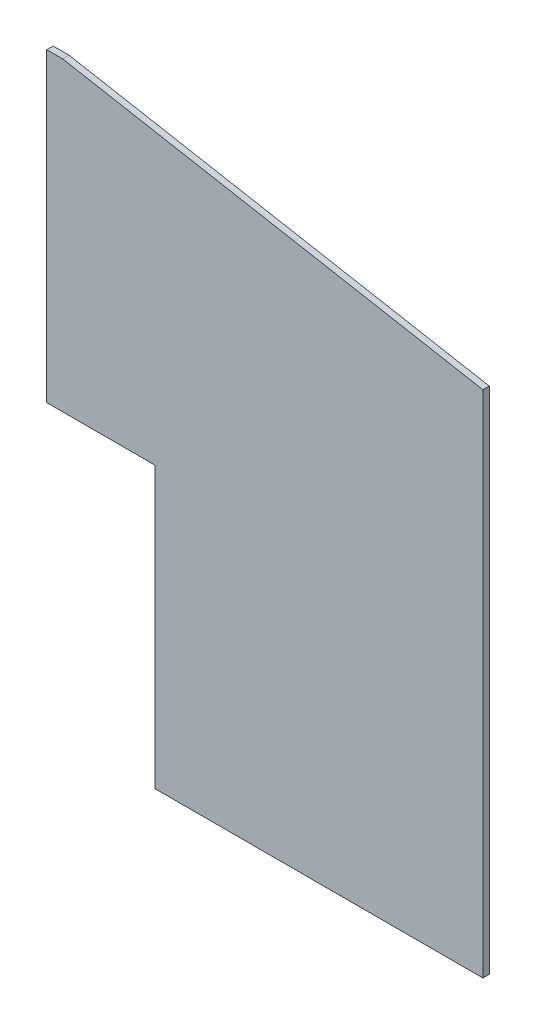
ISO-10303-21;
HEADER;
FILE_DESCRIPTION(('STEP AP214'),'2;1');
FILE_NAME('part.step','',(''),(''),'','','');
FILE_SCHEMA(('AUTOMOTIVE_DESIGN { 1 0 10303 214 1 1 1 1 }'));
ENDSEC;
DATA;
#1=APPLICATION_CONTEXT('core data for automotive mechanical design processes');
#2=APPLICATION_PROTOCOL_DEFINITION('international standard','automotive_design',2000,#1);
#3=PRODUCT_CONTEXT('',#1,'mechanical');
#4=PRODUCT('Part','Part','',(#3));
#5=PRODUCT_RELATED_PRODUCT_CATEGORY('part','',(#4));
#6=PRODUCT_DEFINITION_FORMATION('','',#4);
#7=PRODUCT_DEFINITION_CONTEXT('part definition',#1,'design');
#8=PRODUCT_DEFINITION('design','',#6,#7);
#9=PRODUCT_DEFINITION_SHAPE('','',#8);
#10=(LENGTH_UNIT() NAMED_UNIT(*) SI_UNIT(.MILLI.,.METRE.));
#11=(NAMED_UNIT(*) PLANE_ANGLE_UNIT() SI_UNIT($,.RADIAN.));
#12=(NAMED_UNIT(*) SI_UNIT($,.STERADIAN.) SOLID_ANGLE_UNIT());
#13=UNCERTAINTY_MEASURE_WITH_UNIT(LENGTH_MEASURE(1.E-05),#10,'distance_accuracy_value','');
#14=(GEOMETRIC_REPRESENTATION_CONTEXT(3) GLOBAL_UNCERTAINTY_ASSIGNED_CONTEXT((#13)) GLOBAL_UNIT_ASSIGNED_CONTEXT((#10,
#11,#12)) REPRESENTATION_CONTEXT('',''));
#15=CARTESIAN_POINT('',(0.,0.,0.));
#16=DIRECTION('',(0.,0.,1.));
#17=DIRECTION('',(1.,0.,0.));
#18=AXIS2_PLACEMENT_3D('',#15,#16,#17);
#19=CARTESIAN_POINT('',(2500.,-1.18616867488059E-13,-10.));
#20=DIRECTION('',(0.,-1.,0.));
#21=DIRECTION('',(1.,0.,0.));
#22=AXIS2_PLACEMENT_3D('',#19,#20,#21);
#23=PLANE('',#22);
#24=DIRECTION('',(0.,0.,1.));
#25=VECTOR('',#24,1.);
#26=CARTESIAN_POINT('',(1985.,0.,-10.));
#27=LINE('',#26,#25);
#28=CARTESIAN_POINT('',(1985.,0.,-10.));
#29=VERTEX_POINT('',#28);
#30=CARTESIAN_POINT('',(1985.,0.,0.));
#31=VERTEX_POINT('',#30);
#32=EDGE_CURVE('E61',#29,#31,#27,.T.);
#33=ORIENTED_EDGE('',*,*,#32,.F.);
#34=DIRECTION('',(1.,0.,0.));
#35=VECTOR('',#34,1.);
#36=CARTESIAN_POINT('',(2500.,-1.18616867488059E-13,-10.));
#37=LINE('',#36,#35);
#38=CARTESIAN_POINT('',(2500.,-1.18616867488059E-13,-10.));
#39=VERTEX_POINT('',#38);
#40=EDGE_CURVE('E140',#29,#39,#37,.T.);
#41=ORIENTED_EDGE('',*,*,#40,.T.);
#42=DIRECTION('',(0.,0.,1.));
#43=VECTOR('',#42,1.);
#44=CARTESIAN_POINT('',(2500.,-1.18616867488059E-13,-10.));
#45=LINE('',#44,#43);
#46=CARTESIAN_POINT('',(2500.,-1.18616867488059E-13,0.));
#47=VERTEX_POINT('',#46);
#48=EDGE_CURVE('E119',#39,#47,#45,.T.);
#49=ORIENTED_EDGE('',*,*,#48,.T.);
#50=DIRECTION('',(1.,0.,0.));
#51=VECTOR('',#50,1.);
#52=CARTESIAN_POINT('',(2500.,-1.18616867488059E-13,0.));
#53=LINE('',#52,#51);
#54=EDGE_CURVE('E129',#31,#47,#53,.T.);
#55=ORIENTED_EDGE('',*,*,#54,.F.);
#56=EDGE_LOOP('',(#33,#41,#49,#55));
#57=FACE_BOUND('',#56,.T.);
#58=ADVANCED_FACE('F40',(#57),#23,.T.);
#59=CARTESIAN_POINT('',(660.,920.,-10.));
#60=DIRECTION('',(0.,1.,0.));
#61=DIRECTION('',(-1.,0.,0.));
#62=AXIS2_PLACEMENT_3D('',#59,#60,#61);
#63=PLANE('',#62);
#64=DIRECTION('',(0.,0.,-1.));
#65=VECTOR('',#64,1.);
#66=CARTESIAN_POINT('',(1815.,920.,-10.));
#67=LINE('',#66,#65);
#68=CARTESIAN_POINT('',(1815.,920.,0.));
#69=VERTEX_POINT('',#68);
#70=CARTESIAN_POINT('',(1815.,920.,-10.));
#71=VERTEX_POINT('',#70);
#72=EDGE_CURVE('E96',#69,#71,#67,.T.);
#73=ORIENTED_EDGE('',*,*,#72,.F.);
#74=DIRECTION('',(-1.,0.,0.));
#75=VECTOR('',#74,1.);
#76=CARTESIAN_POINT('',(660.,920.,0.));
#77=LINE('',#76,#75);
#78=CARTESIAN_POINT('',(1840.,920.,0.));
#79=VERTEX_POINT('',#78);
#80=EDGE_CURVE('E138',#79,#69,#77,.T.);
#81=ORIENTED_EDGE('',*,*,#80,.F.);
#82=DIRECTION('',(0.,0.,1.));
#83=VECTOR('',#82,1.);
#84=CARTESIAN_POINT('',(1840.,920.,-10.));
#85=LINE('',#84,#83);
#86=CARTESIAN_POINT('',(1840.,920.,-10.));
#87=VERTEX_POINT('',#86);
#88=EDGE_CURVE('E118',#87,#79,#85,.T.);
#89=ORIENTED_EDGE('',*,*,#88,.F.);
#90=DIRECTION('',(-1.,0.,0.));
#91=VECTOR('',#90,1.);
#92=CARTESIAN_POINT('',(660.,920.,-10.));
#93=LINE('',#92,#91);
#94=EDGE_CURVE('E111',#87,#71,#93,.T.);
#95=ORIENTED_EDGE('',*,*,#94,.T.);
#96=EDGE_LOOP('',(#73,#81,#89,#95));
#97=FACE_BOUND('',#96,.T.);
#98=ADVANCED_FACE('F117',(#97),#63,.T.);
#99=CARTESIAN_POINT('',(1840.,920.,-10.));
#100=DIRECTION('',(0.178885438199983,0.983869910099907,0.));
#101=DIRECTION('',(-0.983869910099907,0.178885438199983,0.));
#102=AXIS2_PLACEMENT_3D('',#99,#100,#101);
#103=PLANE('',#102);
#104=DIRECTION('',(-0.983869910099908,0.178885438199983,0.));
#105=VECTOR('',#104,1.);
#106=CARTESIAN_POINT('',(1840.,920.,0.));
#107=LINE('',#106,#105);
#108=CARTESIAN_POINT('',(2500.,800.,0.));
#109=VERTEX_POINT('',#108);
#110=EDGE_CURVE('E135',#109,#79,#107,.T.);
#111=ORIENTED_EDGE('',*,*,#110,.F.);
#112=DIRECTION('',(0.,0.,1.));
#113=VECTOR('',#112,1.);
#114=CARTESIAN_POINT('',(2500.,800.,-10.));
#115=LINE('',#114,#113);
#116=CARTESIAN_POINT('',(2500.,800.,-10.));
#117=VERTEX_POINT('',#116);
#118=EDGE_CURVE('E123',#117,#109,#115,.T.);
#119=ORIENTED_EDGE('',*,*,#118,.F.);
#120=DIRECTION('',(-0.983869910099908,0.178885438199983,0.));
#121=VECTOR('',#120,1.);
#122=CARTESIAN_POINT('',(1840.,920.,-10.));
#123=LINE('',#122,#121);
#124=EDGE_CURVE('E120',#117,#87,#123,.T.);
#125=ORIENTED_EDGE('',*,*,#124,.T.);
#126=ORIENTED_EDGE('',*,*,#88,.T.);
#127=EDGE_LOOP('',(#111,#119,#125,#126));
#128=FACE_BOUND('',#127,.T.);
#129=ADVANCED_FACE('F166',(#128),#103,.T.);
#130=CARTESIAN_POINT('',(2500.,800.,-10.));
#131=DIRECTION('',(1.,0.,0.));
#132=DIRECTION('',(0.,0.,-1.));
#133=AXIS2_PLACEMENT_3D('',#130,#131,#132);
#134=PLANE('',#133);
#135=DIRECTION('',(0.,1.,0.));
#136=VECTOR('',#135,1.);
#137=CARTESIAN_POINT('',(2500.,800.,0.));
#138=LINE('',#137,#136);
#139=EDGE_CURVE('E131',#47,#109,#138,.T.);
#140=ORIENTED_EDGE('',*,*,#139,.F.);
#141=ORIENTED_EDGE('',*,*,#48,.F.);
#142=DIRECTION('',(0.,1.,0.));
#143=VECTOR('',#142,1.);
#144=CARTESIAN_POINT('',(2500.,800.,-10.));
#145=LINE('',#144,#143);
#146=EDGE_CURVE('E125',#39,#117,#145,.T.);
#147=ORIENTED_EDGE('',*,*,#146,.T.);
#148=ORIENTED_EDGE('',*,*,#118,.T.);
#149=EDGE_LOOP('',(#140,#141,#147,#148));
#150=FACE_BOUND('',#149,.T.);
#151=ADVANCED_FACE('F162',(#150),#134,.T.);
#152=CARTESIAN_POINT('',(0.,0.,-10.));
#153=DIRECTION('',(0.,0.,-1.));
#154=DIRECTION('',(-1.,0.,0.));
#155=AXIS2_PLACEMENT_3D('',#152,#153,#154);
#156=PLANE('',#155);
#157=DIRECTION('',(0.,1.,0.));
#158=VECTOR('',#157,1.);
#159=CARTESIAN_POINT('',(1815.,979.837071857609,-10.));
#160=LINE('',#159,#158);
#161=CARTESIAN_POINT('',(1815.,440.,-10.));
#162=VERTEX_POINT('',#161);
#163=EDGE_CURVE('E54',#162,#71,#160,.T.);
#164=ORIENTED_EDGE('',*,*,#163,.T.);
#165=ORIENTED_EDGE('',*,*,#94,.F.);
#166=ORIENTED_EDGE('',*,*,#124,.F.);
#167=ORIENTED_EDGE('',*,*,#146,.F.);
#168=ORIENTED_EDGE('',*,*,#40,.F.);
#169=DIRECTION('',(0.,1.,0.));
#170=VECTOR('',#169,1.);
#171=CARTESIAN_POINT('',(1985.,0.,-10.));
#172=LINE('',#171,#170);
#173=CARTESIAN_POINT('',(1985.,440.,-10.));
#174=VERTEX_POINT('',#173);
#175=EDGE_CURVE('E104',#29,#174,#172,.T.);
#176=ORIENTED_EDGE('',*,*,#175,.T.);
#177=DIRECTION('',(-1.,0.,0.));
#178=VECTOR('',#177,1.);
#179=CARTESIAN_POINT('',(0.,440.,-10.));
#180=LINE('',#179,#178);
#181=EDGE_CURVE('E115',#174,#162,#180,.T.);
#182=ORIENTED_EDGE('',*,*,#181,.T.);
#183=EDGE_LOOP('',(#164,#165,#166,#167,#168,#176,#182));
#184=FACE_BOUND('',#183,.T.);
#185=ADVANCED_FACE('F109',(#184),#156,.T.);
#186=CARTESIAN_POINT('',(0.,0.,0.));
#187=DIRECTION('',(0.,0.,-1.));
#188=DIRECTION('',(-1.,0.,0.));
#189=AXIS2_PLACEMENT_3D('',#186,#187,#188);
#190=PLANE('',#189);
#191=ORIENTED_EDGE('',*,*,#80,.T.);
#192=DIRECTION('',(0.,-1.,0.));
#193=VECTOR('',#192,1.);
#194=CARTESIAN_POINT('',(1815.,0.,0.));
#195=LINE('',#194,#193);
#196=CARTESIAN_POINT('',(1815.,440.,0.));
#197=VERTEX_POINT('',#196);
#198=EDGE_CURVE('E99',#69,#197,#195,.T.);
#199=ORIENTED_EDGE('',*,*,#198,.T.);
#200=DIRECTION('',(1.,0.,0.));
#201=VECTOR('',#200,1.);
#202=CARTESIAN_POINT('',(0.,440.,0.));
#203=LINE('',#202,#201);
#204=CARTESIAN_POINT('',(1985.,440.,0.));
#205=VERTEX_POINT('',#204);
#206=EDGE_CURVE('E47',#197,#205,#203,.T.);
#207=ORIENTED_EDGE('',*,*,#206,.T.);
#208=DIRECTION('',(0.,-1.,0.));
#209=VECTOR('',#208,1.);
#210=CARTESIAN_POINT('',(1985.,0.,0.));
#211=LINE('',#210,#209);
#212=EDGE_CURVE('E142',#205,#31,#211,.T.);
#213=ORIENTED_EDGE('',*,*,#212,.T.);
#214=ORIENTED_EDGE('',*,*,#54,.T.);
#215=ORIENTED_EDGE('',*,*,#139,.T.);
#216=ORIENTED_EDGE('',*,*,#110,.T.);
#217=EDGE_LOOP('',(#191,#199,#207,#213,#214,#215,#216));
#218=FACE_BOUND('',#217,.T.);
#219=ADVANCED_FACE('F146',(#218),#190,.F.);
#220=CARTESIAN_POINT('',(0.,440.,-10.));
#221=DIRECTION('',(0.,1.,0.));
#222=DIRECTION('',(0.,0.,1.));
#223=AXIS2_PLACEMENT_3D('',#220,#221,#222);
#224=PLANE('',#223);
#225=ORIENTED_EDGE('',*,*,#206,.F.);
#226=DIRECTION('',(0.,0.,-1.));
#227=VECTOR('',#226,1.);
#228=CARTESIAN_POINT('',(1815.,440.,-10.));
#229=LINE('',#228,#227);
#230=EDGE_CURVE('E11',#197,#162,#229,.T.);
#231=ORIENTED_EDGE('',*,*,#230,.T.);
#232=ORIENTED_EDGE('',*,*,#181,.F.);
#233=DIRECTION('',(0.,0.,1.));
#234=VECTOR('',#233,1.);
#235=CARTESIAN_POINT('',(1985.,440.,-10.));
#236=LINE('',#235,#234);
#237=EDGE_CURVE('E132',#174,#205,#236,.T.);
#238=ORIENTED_EDGE('',*,*,#237,.T.);
#239=EDGE_LOOP('',(#225,#231,#232,#238));
#240=FACE_BOUND('',#239,.T.);
#241=ADVANCED_FACE('F151',(#240),#224,.F.);
#242=CARTESIAN_POINT('',(1985.,0.,-10.));
#243=DIRECTION('',(1.,0.,0.));
#244=DIRECTION('',(0.,0.,-1.));
#245=AXIS2_PLACEMENT_3D('',#242,#243,#244);
#246=PLANE('',#245);
#247=ORIENTED_EDGE('',*,*,#237,.F.);
#248=ORIENTED_EDGE('',*,*,#175,.F.);
#249=ORIENTED_EDGE('',*,*,#32,.T.);
#250=ORIENTED_EDGE('',*,*,#212,.F.);
#251=EDGE_LOOP('',(#247,#248,#249,#250));
#252=FACE_BOUND('',#251,.T.);
#253=ADVANCED_FACE('F150',(#252),#246,.F.);
#254=CARTESIAN_POINT('',(1815.,979.837071857609,-10.));
#255=DIRECTION('',(1.,0.,0.));
#256=DIRECTION('',(0.,0.,-1.));
#257=AXIS2_PLACEMENT_3D('',#254,#255,#256);
#258=PLANE('',#257);
#259=ORIENTED_EDGE('',*,*,#72,.T.);
#260=ORIENTED_EDGE('',*,*,#163,.F.);
#261=ORIENTED_EDGE('',*,*,#230,.F.);
#262=ORIENTED_EDGE('',*,*,#198,.F.);
#263=EDGE_LOOP('',(#259,#260,#261,#262));
#264=FACE_BOUND('',#263,.T.);
#265=ADVANCED_FACE('F97',(#264),#258,.F.);
#266=CLOSED_SHELL('',(#58,#98,#129,#151,#185,#219,#241,#253,#265));
#267=MANIFOLD_SOLID_BREP('B2',#266);
#268=ADVANCED_BREP_SHAPE_REPRESENTATION('',(#18,#267),#14);
#269=SHAPE_DEFINITION_REPRESENTATION(#9,#268);
ENDSEC;
END-ISO-10303-21;
